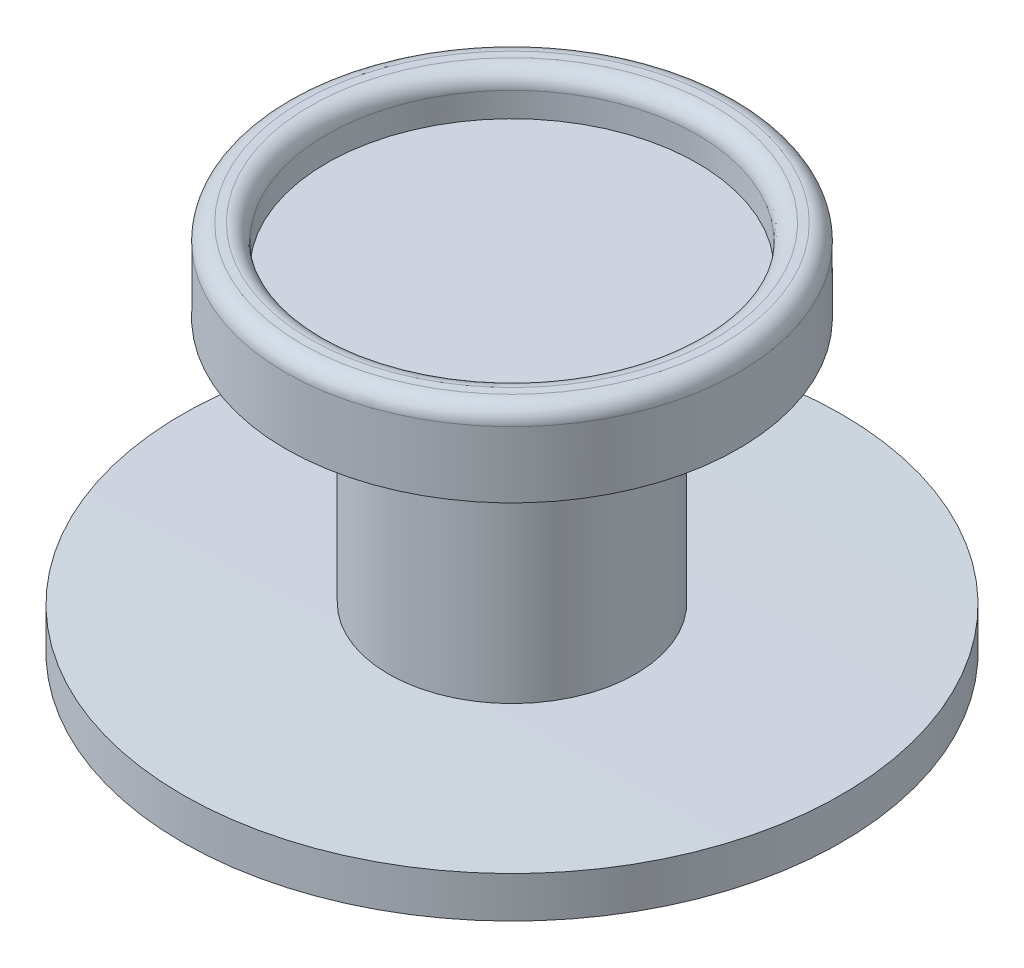
ISO-10303-21;
HEADER;
FILE_DESCRIPTION(('STEP AP214'),'2;1');
FILE_NAME('part.step','',(''),(''),'','','');
FILE_SCHEMA(('AUTOMOTIVE_DESIGN { 1 0 10303 214 1 1 1 1 }'));
ENDSEC;
DATA;
#1=APPLICATION_CONTEXT('core data for automotive mechanical design processes');
#2=APPLICATION_PROTOCOL_DEFINITION('international standard','automotive_design',2000,#1);
#3=PRODUCT_CONTEXT('',#1,'mechanical');
#4=PRODUCT('Part','Part','',(#3));
#5=PRODUCT_RELATED_PRODUCT_CATEGORY('part','',(#4));
#6=PRODUCT_DEFINITION_FORMATION('','',#4);
#7=PRODUCT_DEFINITION_CONTEXT('part definition',#1,'design');
#8=PRODUCT_DEFINITION('design','',#6,#7);
#9=PRODUCT_DEFINITION_SHAPE('','',#8);
#10=(LENGTH_UNIT() NAMED_UNIT(*) SI_UNIT(.MILLI.,.METRE.));
#11=(NAMED_UNIT(*) PLANE_ANGLE_UNIT() SI_UNIT($,.RADIAN.));
#12=(NAMED_UNIT(*) SI_UNIT($,.STERADIAN.) SOLID_ANGLE_UNIT());
#13=UNCERTAINTY_MEASURE_WITH_UNIT(LENGTH_MEASURE(1.E-05),#10,'distance_accuracy_value','');
#14=(GEOMETRIC_REPRESENTATION_CONTEXT(3) GLOBAL_UNCERTAINTY_ASSIGNED_CONTEXT((#13)) GLOBAL_UNIT_ASSIGNED_CONTEXT((#10,
#11,#12)) REPRESENTATION_CONTEXT('',''));
#15=CARTESIAN_POINT('',(0.,0.,0.));
#16=DIRECTION('',(0.,0.,1.));
#17=DIRECTION('',(1.,0.,0.));
#18=AXIS2_PLACEMENT_3D('',#15,#16,#17);
#19=CARTESIAN_POINT('',(4.44089209850063E-13,-373.999972894287,-1.12757025938492E-13));
#20=DIRECTION('',(0.,1.00000000000001,0.));
#21=DIRECTION('',(-1.,0.,0.));
#22=AXIS2_PLACEMENT_3D('',#19,#20,#21);
#23=SPHERICAL_SURFACE('',#22,370.);
#24=CARTESIAN_POINT('',(0.,-4.02159514769293,0.));
#25=DIRECTION('',(0.,1.00000000000001,0.));
#26=DIRECTION('',(0.,0.,0.999999999999996));
#27=AXIS2_PLACEMENT_3D('',#24,#25,#26);
#28=CIRCLE('',#27,4.);
#29=CARTESIAN_POINT('',(0.,-4.02159514769293,3.99999999999998));
#30=VERTEX_POINT('',#29);
#31=EDGE_CURVE('E48',#30,#30,#28,.T.);
#32=ORIENTED_EDGE('',*,*,#31,.T.);
#33=EDGE_LOOP('',(#32));
#34=FACE_BOUND('',#33,.T.);
#35=CARTESIAN_POINT('',(-1.11022302462516E-13,-4.00301344731824,0.));
#36=DIRECTION('',(0.,1.00000000000001,0.));
#37=DIRECTION('',(0.,0.,0.999999999999996));
#38=AXIS2_PLACEMENT_3D('',#35,#36,#37);
#39=CIRCLE('',#38,1.49999999999999);
#40=CARTESIAN_POINT('',(-1.11040517059013E-13,-4.00301344731824,1.49999999999999));
#41=VERTEX_POINT('',#40);
#42=EDGE_CURVE('E63',#41,#41,#39,.T.);
#43=ORIENTED_EDGE('',*,*,#42,.F.);
#44=EDGE_LOOP('',(#43));
#45=FACE_BOUND('',#44,.T.);
#46=ADVANCED_FACE('F29',(#34,#45),#23,.T.);
#47=CARTESIAN_POINT('',(0.,39.0295414462082,0.));
#48=DIRECTION('',(0.,1.00000000000001,0.));
#49=DIRECTION('',(0.,0.,0.999999999999996));
#50=AXIS2_PLACEMENT_3D('',#47,#48,#49);
#51=CYLINDRICAL_SURFACE('',#50,4.);
#52=CARTESIAN_POINT('',(-1.11022302462516E-13,-4.52159514769196,0.));
#53=DIRECTION('',(0.,1.00000000000001,0.));
#54=DIRECTION('',(0.,0.,0.999999999999996));
#55=AXIS2_PLACEMENT_3D('',#52,#53,#54);
#56=CIRCLE('',#55,4.);
#57=CARTESIAN_POINT('',(-1.11070874719843E-13,-4.52159514769196,3.99999999999995));
#58=VERTEX_POINT('',#57);
#59=EDGE_CURVE('E51',#58,#58,#56,.T.);
#60=ORIENTED_EDGE('',*,*,#59,.T.);
#61=EDGE_LOOP('',(#60));
#62=FACE_BOUND('',#61,.T.);
#63=ORIENTED_EDGE('',*,*,#31,.F.);
#64=EDGE_LOOP('',(#63));
#65=FACE_BOUND('',#64,.T.);
#66=ADVANCED_FACE('F71',(#62,#65),#51,.T.);
#67=CARTESIAN_POINT('',(-1.11022302462516E-13,11.2284048523074,0.));
#68=DIRECTION('',(0.,1.00000000000001,0.));
#69=DIRECTION('',(-1.,0.,0.));
#70=AXIS2_PLACEMENT_3D('',#67,#68,#69);
#71=SPHERICAL_SURFACE('',#70,16.25);
#72=ORIENTED_EDGE('',*,*,#59,.F.);
#73=EDGE_LOOP('',(#72));
#74=FACE_BOUND('',#73,.T.);
#75=ADVANCED_FACE('F76',(#74),#71,.T.);
#76=CARTESIAN_POINT('',(-2.2500000000002,-0.50676810985853,0.));
#77=DIRECTION('',(0.,1.00000000000001,0.));
#78=DIRECTION('',(0.,0.,0.999999999999996));
#79=AXIS2_PLACEMENT_3D('',#76,#77,#78);
#80=PLANE('',#79);
#81=CARTESIAN_POINT('',(-1.11022302462516E-13,-0.506768109859085,0.));
#82=DIRECTION('',(0.,1.00000000000001,0.));
#83=DIRECTION('',(0.,0.,0.999999999999996));
#84=AXIS2_PLACEMENT_3D('',#81,#82,#83);
#85=CIRCLE('',#84,2.25);
#86=CARTESIAN_POINT('',(-1.11049624357262E-13,-0.506768109859084,2.24999999999996));
#87=VERTEX_POINT('',#86);
#88=EDGE_CURVE('E54',#87,#87,#85,.T.);
#89=ORIENTED_EDGE('',*,*,#88,.T.);
#90=EDGE_LOOP('',(#89));
#91=FACE_BOUND('',#90,.T.);
#92=ADVANCED_FACE('F83',(#91),#80,.T.);
#93=CARTESIAN_POINT('',(0.,39.0295414462082,0.));
#94=DIRECTION('',(0.,1.00000000000001,0.));
#95=DIRECTION('',(0.,0.,0.999999999999996));
#96=AXIS2_PLACEMENT_3D('',#93,#94,#95);
#97=CYLINDRICAL_SURFACE('',#96,2.25);
#98=CARTESIAN_POINT('',(-2.22044604925031E-13,-0.208029113030805,0.));
#99=DIRECTION('',(0.,-1.00000000000001,0.));
#100=DIRECTION('',(0.,0.,-0.999999999999996));
#101=AXIS2_PLACEMENT_3D('',#98,#99,#100);
#102=CIRCLE('',#101,2.25);
#103=CARTESIAN_POINT('',(-2.22017283030285E-13,-0.208029113030806,-2.25000000000001));
#104=VERTEX_POINT('',#103);
#105=EDGE_CURVE('E43',#104,#104,#102,.F.);
#106=ORIENTED_EDGE('',*,*,#105,.T.);
#107=EDGE_LOOP('',(#106));
#108=FACE_BOUND('',#107,.T.);
#109=ORIENTED_EDGE('',*,*,#88,.F.);
#110=EDGE_LOOP('',(#109));
#111=FACE_BOUND('',#110,.T.);
#112=ADVANCED_FACE('F89',(#108,#111),#97,.F.);
#113=CARTESIAN_POINT('',(4.44089209850063E-13,-373.999972894287,-1.12757025938492E-13));
#114=DIRECTION('',(0.,1.00000000000001,0.));
#115=DIRECTION('',(-1.,0.,0.));
#116=AXIS2_PLACEMENT_3D('',#113,#114,#115);
#117=SPHERICAL_SURFACE('',#116,373.999972894285);
#118=CARTESIAN_POINT('',(1.11022302462516E-13,-0.00803340897134741,0.));
#119=DIRECTION('',(0.,-1.00000000000001,0.));
#120=DIRECTION('',(0.,0.,-0.999999999999996));
#121=AXIS2_PLACEMENT_3D('',#118,#119,#120);
#122=CIRCLE('',#121,2.45131086151827);
#123=CARTESIAN_POINT('',(1.11052068888004E-13,-0.00803340897134821,-2.45131086151829));
#124=VERTEX_POINT('',#123);
#125=EDGE_CURVE('E35',#124,#124,#122,.T.);
#126=ORIENTED_EDGE('',*,*,#125,.T.);
#127=EDGE_LOOP('',(#126));
#128=FACE_BOUND('',#127,.T.);
#129=CARTESIAN_POINT('',(-1.11022302462516E-13,-0.00870258868357343,0.));
#130=DIRECTION('',(0.,-1.00000000000001,0.));
#131=DIRECTION('',(0.,0.,-0.999999999999996));
#132=AXIS2_PLACEMENT_3D('',#129,#130,#131);
#133=CIRCLE('',#132,2.55136436607013);
#134=CARTESIAN_POINT('',(-1.10991321080885E-13,-0.00870258868357427,-2.55136436607015));
#135=VERTEX_POINT('',#134);
#136=EDGE_CURVE('E39',#135,#135,#133,.F.);
#137=ORIENTED_EDGE('',*,*,#136,.T.);
#138=EDGE_LOOP('',(#137));
#139=FACE_BOUND('',#138,.T.);
#140=ADVANCED_FACE('F93',(#128,#139),#117,.T.);
#141=CARTESIAN_POINT('',(0.,39.0295414462082,0.));
#142=DIRECTION('',(0.,1.00000000000001,0.));
#143=DIRECTION('',(0.,0.,0.999999999999996));
#144=AXIS2_PLACEMENT_3D('',#141,#142,#143);
#145=CYLINDRICAL_SURFACE('',#144,2.75000000000009);
#146=CARTESIAN_POINT('',(-2.22044604925031E-13,-0.208697934892699,0.));
#147=DIRECTION('',(0.,-1.00000000000001,0.));
#148=DIRECTION('',(0.,0.,-0.999999999999996));
#149=AXIS2_PLACEMENT_3D('',#146,#147,#148);
#150=CIRCLE('',#149,2.75000000000009);
#151=CARTESIAN_POINT('',(-2.22011211498119E-13,-0.2086979348927,-2.75000000000011));
#152=VERTEX_POINT('',#151);
#153=EDGE_CURVE('E10',#152,#152,#150,.T.);
#154=ORIENTED_EDGE('',*,*,#153,.T.);
#155=EDGE_LOOP('',(#154));
#156=FACE_BOUND('',#155,.T.);
#157=CARTESIAN_POINT('',(0.,-1.01011043150917,0.));
#158=DIRECTION('',(0.,1.00000000000001,0.));
#159=DIRECTION('',(0.,0.,0.999999999999996));
#160=AXIS2_PLACEMENT_3D('',#157,#158,#159);
#161=CIRCLE('',#160,2.75000000000009);
#162=CARTESIAN_POINT('',(0.,-1.01011043150917,2.75000000000008));
#163=VERTEX_POINT('',#162);
#164=EDGE_CURVE('E57',#163,#163,#161,.T.);
#165=ORIENTED_EDGE('',*,*,#164,.T.);
#166=EDGE_LOOP('',(#165));
#167=FACE_BOUND('',#166,.T.);
#168=ADVANCED_FACE('F97',(#156,#167),#145,.T.);
#169=CARTESIAN_POINT('',(4.44089209850063E-13,-373.999972894287,-1.12757025938492E-13));
#170=DIRECTION('',(0.,1.00000000000001,0.));
#171=DIRECTION('',(-1.,0.,0.));
#172=AXIS2_PLACEMENT_3D('',#169,#170,#171);
#173=SPHERICAL_SURFACE('',#172,373.);
#174=CARTESIAN_POINT('',(0.,-1.00298899226944,0.));
#175=DIRECTION('',(0.,1.00000000000001,0.));
#176=DIRECTION('',(0.,0.,0.999999999999996));
#177=AXIS2_PLACEMENT_3D('',#174,#175,#176);
#178=CIRCLE('',#177,1.50000000000009);
#179=CARTESIAN_POINT('',(0.,-1.00298899226944,1.50000000000005));
#180=VERTEX_POINT('',#179);
#181=EDGE_CURVE('E60',#180,#180,#178,.T.);
#182=ORIENTED_EDGE('',*,*,#181,.T.);
#183=EDGE_LOOP('',(#182));
#184=FACE_BOUND('',#183,.T.);
#185=ORIENTED_EDGE('',*,*,#164,.F.);
#186=EDGE_LOOP('',(#185));
#187=FACE_BOUND('',#186,.T.);
#188=ADVANCED_FACE('F100',(#184,#187),#173,.F.);
#189=CARTESIAN_POINT('',(0.,39.0295414462082,0.));
#190=DIRECTION('',(0.,1.00000000000001,0.));
#191=DIRECTION('',(0.,0.,0.999999999999996));
#192=AXIS2_PLACEMENT_3D('',#189,#190,#191);
#193=CYLINDRICAL_SURFACE('',#192,1.50000000000004);
#194=ORIENTED_EDGE('',*,*,#42,.T.);
#195=EDGE_LOOP('',(#194));
#196=FACE_BOUND('',#195,.T.);
#197=ORIENTED_EDGE('',*,*,#181,.F.);
#198=EDGE_LOOP('',(#197));
#199=FACE_BOUND('',#198,.T.);
#200=ADVANCED_FACE('F67',(#196,#199),#193,.T.);
#201=CARTESIAN_POINT('',(-2.22044604925031E-13,-0.208029113030805,0.));
#202=DIRECTION('',(0.,-1.00000000000001,0.));
#203=DIRECTION('',(0.,0.,-0.999999999999996));
#204=AXIS2_PLACEMENT_3D('',#201,#202,#203);
#205=TOROIDAL_SURFACE('',#204,2.45,0.2);
#206=ORIENTED_EDGE('',*,*,#125,.F.);
#207=EDGE_LOOP('',(#206));
#208=FACE_BOUND('',#207,.T.);
#209=ORIENTED_EDGE('',*,*,#105,.F.);
#210=EDGE_LOOP('',(#209));
#211=FACE_BOUND('',#210,.T.);
#212=ADVANCED_FACE('F106',(#208,#211),#205,.T.);
#213=CARTESIAN_POINT('',(-2.22044604925031E-13,-0.208697934892699,0.));
#214=DIRECTION('',(0.,-1.00000000000001,0.));
#215=DIRECTION('',(0.,0.,-0.999999999999996));
#216=AXIS2_PLACEMENT_3D('',#213,#214,#215);
#217=TOROIDAL_SURFACE('',#216,2.55000000000009,0.2);
#218=ORIENTED_EDGE('',*,*,#153,.F.);
#219=EDGE_LOOP('',(#218));
#220=FACE_BOUND('',#219,.T.);
#221=ORIENTED_EDGE('',*,*,#136,.F.);
#222=EDGE_LOOP('',(#221));
#223=FACE_BOUND('',#222,.T.);
#224=ADVANCED_FACE('F109',(#220,#223),#217,.T.);
#225=CLOSED_SHELL('',(#46,#66,#75,#92,#112,#140,#168,#188,#200,#212,#224));
#226=MANIFOLD_SOLID_BREP('B2',#225);
#227=ADVANCED_BREP_SHAPE_REPRESENTATION('',(#18,#226),#14);
#228=SHAPE_DEFINITION_REPRESENTATION(#9,#227);
ENDSEC;
END-ISO-10303-21;
